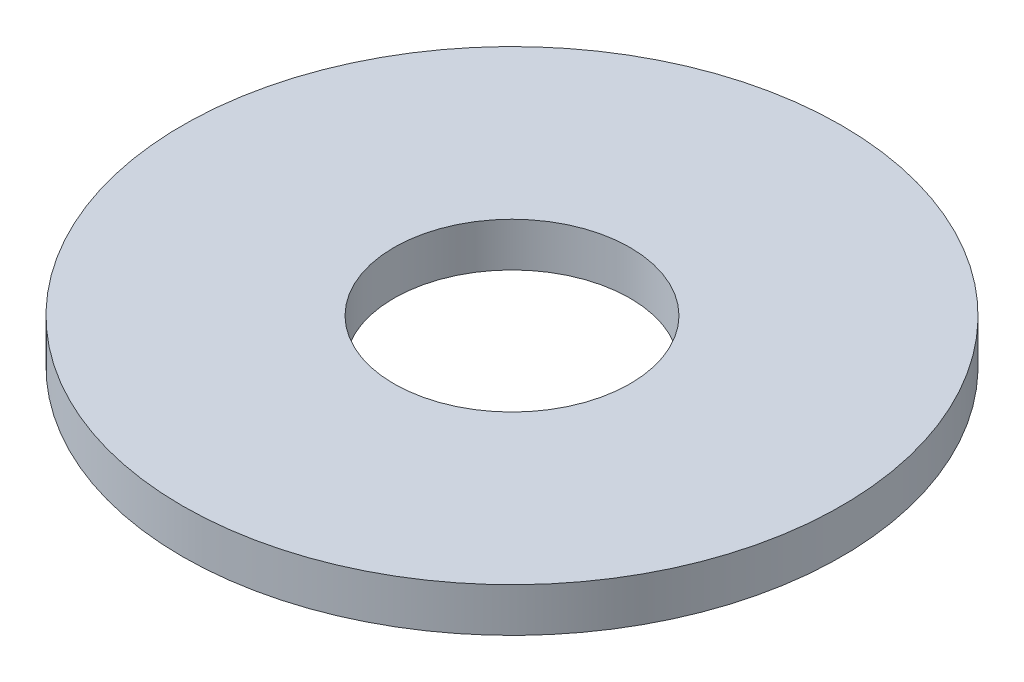
ISO-10303-21;
HEADER;
FILE_DESCRIPTION(('STEP AP214'),'2;1');
FILE_NAME('part.step','',(''),(''),'','','');
FILE_SCHEMA(('AUTOMOTIVE_DESIGN { 1 0 10303 214 1 1 1 1 }'));
ENDSEC;
DATA;
#1=APPLICATION_CONTEXT('core data for automotive mechanical design processes');
#2=APPLICATION_PROTOCOL_DEFINITION('international standard','automotive_design',2000,#1);
#3=PRODUCT_CONTEXT('',#1,'mechanical');
#4=PRODUCT('Part','Part','',(#3));
#5=PRODUCT_RELATED_PRODUCT_CATEGORY('part','',(#4));
#6=PRODUCT_DEFINITION_FORMATION('','',#4);
#7=PRODUCT_DEFINITION_CONTEXT('part definition',#1,'design');
#8=PRODUCT_DEFINITION('design','',#6,#7);
#9=PRODUCT_DEFINITION_SHAPE('','',#8);
#10=(LENGTH_UNIT() NAMED_UNIT(*) SI_UNIT(.MILLI.,.METRE.));
#11=(NAMED_UNIT(*) PLANE_ANGLE_UNIT() SI_UNIT($,.RADIAN.));
#12=(NAMED_UNIT(*) SI_UNIT($,.STERADIAN.) SOLID_ANGLE_UNIT());
#13=UNCERTAINTY_MEASURE_WITH_UNIT(LENGTH_MEASURE(1.E-05),#10,'distance_accuracy_value','');
#14=(GEOMETRIC_REPRESENTATION_CONTEXT(3) GLOBAL_UNCERTAINTY_ASSIGNED_CONTEXT((#13)) GLOBAL_UNIT_ASSIGNED_CONTEXT((#10,
#11,#12)) REPRESENTATION_CONTEXT('',''));
#15=CARTESIAN_POINT('',(0.,0.,0.));
#16=DIRECTION('',(0.,0.,1.));
#17=DIRECTION('',(1.,0.,0.));
#18=AXIS2_PLACEMENT_3D('',#15,#16,#17);
#19=CARTESIAN_POINT('',(0.,1.106976,0.));
#20=DIRECTION('',(0.,1.,0.));
#21=DIRECTION('',(0.,0.,1.));
#22=AXIS2_PLACEMENT_3D('',#19,#20,#21);
#23=PLANE('',#22);
#24=CARTESIAN_POINT('',(0.,1.106976,0.));
#25=DIRECTION('',(0.,1.,0.));
#26=DIRECTION('',(0.,0.,1.));
#27=AXIS2_PLACEMENT_3D('',#24,#25,#26);
#28=CIRCLE('',#27,10.60464);
#29=CARTESIAN_POINT('',(0.,1.106976,10.60464));
#30=VERTEX_POINT('',#29);
#31=EDGE_CURVE('E12',#30,#30,#28,.T.);
#32=ORIENTED_EDGE('',*,*,#31,.T.);
#33=EDGE_LOOP('',(#32));
#34=FACE_BOUND('',#33,.T.);
#35=CARTESIAN_POINT('',(0.,1.106976,0.));
#36=DIRECTION('',(0.,1.,0.));
#37=DIRECTION('',(0.,0.,1.));
#38=AXIS2_PLACEMENT_3D('',#35,#36,#37);
#39=CIRCLE('',#38,3.799996);
#40=CARTESIAN_POINT('',(0.,1.106976,3.799996));
#41=VERTEX_POINT('',#40);
#42=EDGE_CURVE('E55',#41,#41,#39,.T.);
#43=ORIENTED_EDGE('',*,*,#42,.F.);
#44=EDGE_LOOP('',(#43));
#45=FACE_BOUND('',#44,.T.);
#46=ADVANCED_FACE('F44',(#34,#45),#23,.T.);
#47=CARTESIAN_POINT('',(0.,-0.306976,0.));
#48=DIRECTION('',(0.,1.,0.));
#49=DIRECTION('',(0.,0.,1.));
#50=AXIS2_PLACEMENT_3D('',#47,#48,#49);
#51=PLANE('',#50);
#52=CARTESIAN_POINT('',(0.,-0.306976,0.));
#53=DIRECTION('',(0.,1.,0.));
#54=DIRECTION('',(0.,0.,1.));
#55=AXIS2_PLACEMENT_3D('',#52,#53,#54);
#56=CIRCLE('',#55,10.60464);
#57=CARTESIAN_POINT('',(0.,-0.306976,10.60464));
#58=VERTEX_POINT('',#57);
#59=EDGE_CURVE('E48',#58,#58,#56,.T.);
#60=ORIENTED_EDGE('',*,*,#59,.F.);
#61=EDGE_LOOP('',(#60));
#62=FACE_BOUND('',#61,.T.);
#63=CARTESIAN_POINT('',(0.,-0.306976,0.));
#64=DIRECTION('',(0.,1.,0.));
#65=DIRECTION('',(0.,0.,1.));
#66=AXIS2_PLACEMENT_3D('',#63,#64,#65);
#67=CIRCLE('',#66,3.799996);
#68=CARTESIAN_POINT('',(0.,-0.306976,3.799996));
#69=VERTEX_POINT('',#68);
#70=EDGE_CURVE('E57',#69,#69,#67,.T.);
#71=ORIENTED_EDGE('',*,*,#70,.T.);
#72=EDGE_LOOP('',(#71));
#73=FACE_BOUND('',#72,.T.);
#74=ADVANCED_FACE('F67',(#62,#73),#51,.F.);
#75=CARTESIAN_POINT('',(0.,1.106976,0.));
#76=DIRECTION('',(0.,-1.,0.));
#77=DIRECTION('',(0.,0.,-1.));
#78=AXIS2_PLACEMENT_3D('',#75,#76,#77);
#79=CYLINDRICAL_SURFACE('',#78,10.60464);
#80=ORIENTED_EDGE('',*,*,#31,.F.);
#81=EDGE_LOOP('',(#80));
#82=FACE_BOUND('',#81,.T.);
#83=ORIENTED_EDGE('',*,*,#59,.T.);
#84=EDGE_LOOP('',(#83));
#85=FACE_BOUND('',#84,.T.);
#86=ADVANCED_FACE('F46',(#82,#85),#79,.T.);
#87=CARTESIAN_POINT('',(0.,1.106976,0.));
#88=DIRECTION('',(0.,-1.,0.));
#89=DIRECTION('',(0.,0.,-1.));
#90=AXIS2_PLACEMENT_3D('',#87,#88,#89);
#91=CYLINDRICAL_SURFACE('',#90,3.799996);
#92=ORIENTED_EDGE('',*,*,#42,.T.);
#93=EDGE_LOOP('',(#92));
#94=FACE_BOUND('',#93,.T.);
#95=ORIENTED_EDGE('',*,*,#70,.F.);
#96=EDGE_LOOP('',(#95));
#97=FACE_BOUND('',#96,.T.);
#98=ADVANCED_FACE('F63',(#94,#97),#91,.F.);
#99=CLOSED_SHELL('',(#46,#74,#86,#98));
#100=MANIFOLD_SOLID_BREP('B2',#99);
#101=ADVANCED_BREP_SHAPE_REPRESENTATION('',(#18,#100),#14);
#102=SHAPE_DEFINITION_REPRESENTATION(#9,#101);
ENDSEC;
END-ISO-10303-21;
